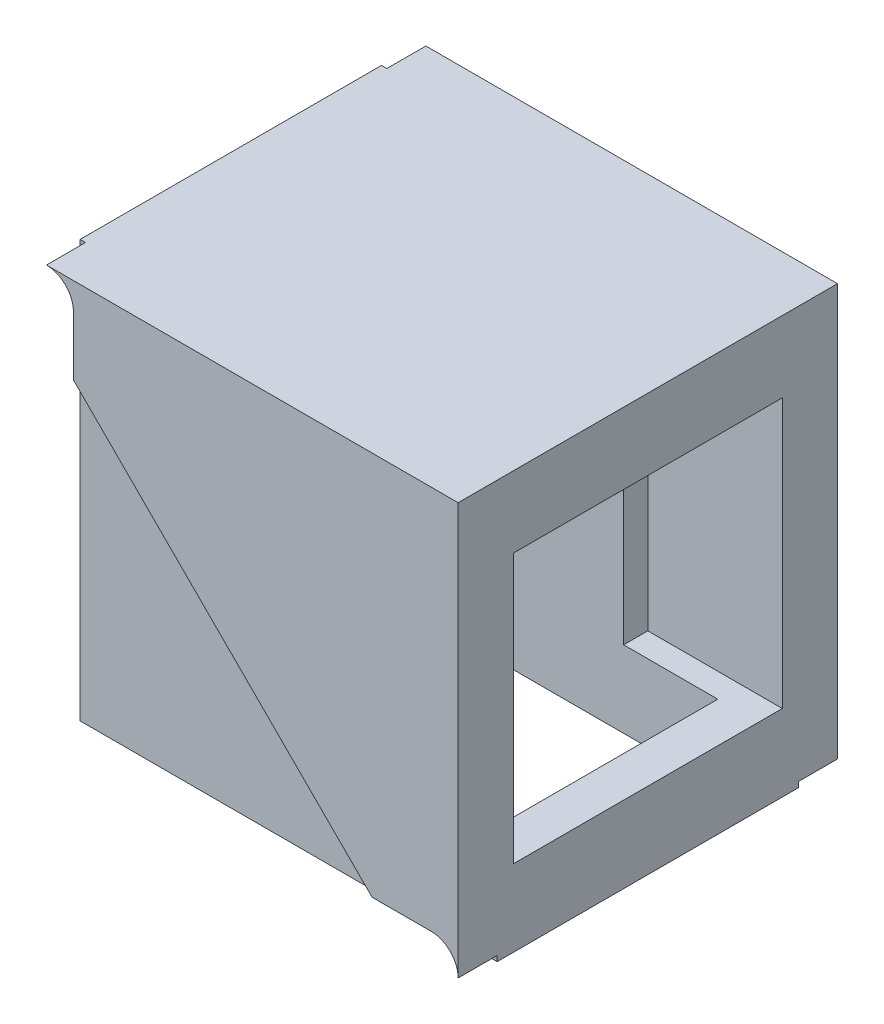
ISO-10303-21;
HEADER;
FILE_DESCRIPTION(('STEP AP214'),'2;1');
FILE_NAME('part.step','',(''),(''),'','','');
FILE_SCHEMA(('AUTOMOTIVE_DESIGN { 1 0 10303 214 1 1 1 1 }'));
ENDSEC;
DATA;
#1=APPLICATION_CONTEXT('core data for automotive mechanical design processes');
#2=APPLICATION_PROTOCOL_DEFINITION('international standard','automotive_design',2000,#1);
#3=PRODUCT_CONTEXT('',#1,'mechanical');
#4=PRODUCT('Part','Part','',(#3));
#5=PRODUCT_RELATED_PRODUCT_CATEGORY('part','',(#4));
#6=PRODUCT_DEFINITION_FORMATION('','',#4);
#7=PRODUCT_DEFINITION_CONTEXT('part definition',#1,'design');
#8=PRODUCT_DEFINITION('design','',#6,#7);
#9=PRODUCT_DEFINITION_SHAPE('','',#8);
#10=(LENGTH_UNIT() NAMED_UNIT(*) SI_UNIT(.MILLI.,.METRE.));
#11=(NAMED_UNIT(*) PLANE_ANGLE_UNIT() SI_UNIT($,.RADIAN.));
#12=(NAMED_UNIT(*) SI_UNIT($,.STERADIAN.) SOLID_ANGLE_UNIT());
#13=UNCERTAINTY_MEASURE_WITH_UNIT(LENGTH_MEASURE(1.E-05),#10,'distance_accuracy_value','');
#14=(GEOMETRIC_REPRESENTATION_CONTEXT(3) GLOBAL_UNCERTAINTY_ASSIGNED_CONTEXT((#13)) GLOBAL_UNIT_ASSIGNED_CONTEXT((#10,
#11,#12)) REPRESENTATION_CONTEXT('',''));
#15=CARTESIAN_POINT('',(0.,0.,0.));
#16=DIRECTION('',(0.,0.,1.));
#17=DIRECTION('',(1.,0.,0.));
#18=AXIS2_PLACEMENT_3D('',#15,#16,#17);
#19=CARTESIAN_POINT('',(32.0000000000212,3.99999999998279,-66.0406204336012));
#20=DIRECTION('',(1.,0.,0.));
#21=DIRECTION('',(0.,0.,-1.));
#22=AXIS2_PLACEMENT_3D('',#19,#20,#21);
#23=PLANE('',#22);
#24=DIRECTION('',(0.,1.,0.));
#25=VECTOR('',#24,1.);
#26=CARTESIAN_POINT('',(32.0000000000186,3.9999999999828,-5.80000000003517));
#27=LINE('',#26,#25);
#28=CARTESIAN_POINT('',(32.0000000000186,3.99999999998273,-5.80000000003517));
#29=VERTEX_POINT('',#28);
#30=CARTESIAN_POINT('',(32.0000000000186,9.69999999998245,-5.80000000003517));
#31=VERTEX_POINT('',#30);
#32=EDGE_CURVE('E354',#29,#31,#27,.T.);
#33=ORIENTED_EDGE('',*,*,#32,.T.);
#34=DIRECTION('',(0.,0.,-1.));
#35=VECTOR('',#34,1.);
#36=CARTESIAN_POINT('',(32.0000000000212,9.69999999998246,-66.0406204336012));
#37=LINE('',#36,#35);
#38=CARTESIAN_POINT('',(32.0000000000193,9.69999999998246,-22.2000000000352));
#39=VERTEX_POINT('',#38);
#40=EDGE_CURVE('E272',#31,#39,#37,.T.);
#41=ORIENTED_EDGE('',*,*,#40,.T.);
#42=DIRECTION('',(0.,-1.,0.));
#43=VECTOR('',#42,1.);
#44=CARTESIAN_POINT('',(32.0000000000193,3.99999999998279,-22.2000000000352));
#45=LINE('',#44,#43);
#46=CARTESIAN_POINT('',(32.0000000000203,3.99999999998273,-22.2000000000352));
#47=VERTEX_POINT('',#46);
#48=EDGE_CURVE('E348',#39,#47,#45,.T.);
#49=ORIENTED_EDGE('',*,*,#48,.T.);
#50=DIRECTION('',(0.,0.,1.));
#51=VECTOR('',#50,1.);
#52=CARTESIAN_POINT('',(32.0000000000212,3.99999999998279,-66.0406204336012));
#53=LINE('',#52,#51);
#54=EDGE_CURVE('E349',#47,#29,#53,.T.);
#55=ORIENTED_EDGE('',*,*,#54,.T.);
#56=EDGE_LOOP('',(#33,#41,#49,#55));
#57=FACE_BOUND('',#56,.T.);
#58=ADVANCED_FACE('F41',(#57),#23,.F.);
#59=CARTESIAN_POINT('',(1.10838757527151E-12,0.,-25.2000000000366));
#60=DIRECTION('',(0.,0.,1.));
#61=DIRECTION('',(1.,0.,0.));
#62=AXIS2_PLACEMENT_3D('',#59,#60,#61);
#63=PLANE('',#62);
#64=CARTESIAN_POINT('',(33.0000000000195,4.39999999998272,-25.2000000000351));
#65=DIRECTION('',(0.,0.,1.));
#66=DIRECTION('',(-1.,0.,0.));
#67=AXIS2_PLACEMENT_3D('',#64,#65,#66);
#68=CIRCLE('',#67,2.);
#69=CARTESIAN_POINT('',(35.0000000000195,4.39999999998272,-25.200000000035));
#70=VERTEX_POINT('',#69);
#71=CARTESIAN_POINT('',(33.0000000000195,6.39999999998272,-25.2000000000351));
#72=VERTEX_POINT('',#71);
#73=EDGE_CURVE('E391',#70,#72,#68,.T.);
#74=ORIENTED_EDGE('',*,*,#73,.F.);
#75=DIRECTION('',(0.,1.,0.));
#76=VECTOR('',#75,1.);
#77=CARTESIAN_POINT('',(35.0000000000195,3.9999999999828,-25.200000000035));
#78=LINE('',#77,#76);
#79=CARTESIAN_POINT('',(35.0000000000195,3.9999999999828,-25.200000000035));
#80=VERTEX_POINT('',#79);
#81=EDGE_CURVE('E416',#80,#70,#78,.T.);
#82=ORIENTED_EDGE('',*,*,#81,.F.);
#83=DIRECTION('',(1.,0.,0.));
#84=VECTOR('',#83,1.);
#85=CARTESIAN_POINT('',(4.00000000001943,3.99999999998213,-25.2000000000364));
#86=LINE('',#85,#84);
#87=CARTESIAN_POINT('',(4.00000000001943,3.99999999998213,-25.2000000000364));
#88=VERTEX_POINT('',#87);
#89=EDGE_CURVE('E420',#88,#80,#86,.T.);
#90=ORIENTED_EDGE('',*,*,#89,.F.);
#91=DIRECTION('',(0.,-1.,0.));
#92=VECTOR('',#91,1.);
#93=CARTESIAN_POINT('',(4.00000000001877,34.9999999999822,-25.2000000000364));
#94=LINE('',#93,#92);
#95=CARTESIAN_POINT('',(4.00000000001877,34.9999999999822,-25.2000000000364));
#96=VERTEX_POINT('',#95);
#97=EDGE_CURVE('E428',#96,#88,#94,.T.);
#98=ORIENTED_EDGE('',*,*,#97,.F.);
#99=DIRECTION('',(-1.,0.,0.));
#100=VECTOR('',#99,1.);
#101=CARTESIAN_POINT('',(35.0000000000195,34.9999999999822,-25.200000000035));
#102=LINE('',#101,#100);
#103=CARTESIAN_POINT('',(4.40000000001884,34.9999999999821,-25.2000000000364));
#104=VERTEX_POINT('',#103);
#105=EDGE_CURVE('E426',#104,#96,#102,.T.);
#106=ORIENTED_EDGE('',*,*,#105,.F.);
#107=CARTESIAN_POINT('',(4.40000000001888,32.9999999999821,-25.2000000000364));
#108=DIRECTION('',(0.,0.,1.));
#109=DIRECTION('',(-1.,0.,0.));
#110=AXIS2_PLACEMENT_3D('',#107,#108,#109);
#111=CIRCLE('',#110,2.);
#112=CARTESIAN_POINT('',(6.40000000001888,32.9999999999822,-25.2000000000363));
#113=VERTEX_POINT('',#112);
#114=EDGE_CURVE('E388',#113,#104,#111,.T.);
#115=ORIENTED_EDGE('',*,*,#114,.F.);
#116=DIRECTION('',(0.,1.,0.));
#117=VECTOR('',#116,1.);
#118=CARTESIAN_POINT('',(6.40000000001897,28.5999999999822,-25.2000000000363));
#119=LINE('',#118,#117);
#120=CARTESIAN_POINT('',(6.40000000001897,28.5999999999822,-25.2000000000363));
#121=VERTEX_POINT('',#120);
#122=EDGE_CURVE('E353',#121,#113,#119,.T.);
#123=ORIENTED_EDGE('',*,*,#122,.F.);
#124=DIRECTION('',(-0.707106781186563,0.707106781186532,0.));
#125=VECTOR('',#124,1.);
#126=CARTESIAN_POINT('',(6.40000000001897,28.5999999999822,-25.2000000000363));
#127=LINE('',#126,#125);
#128=CARTESIAN_POINT('',(28.6000000000195,6.39999999998262,-25.2000000000353));
#129=VERTEX_POINT('',#128);
#130=EDGE_CURVE('E372',#129,#121,#127,.T.);
#131=ORIENTED_EDGE('',*,*,#130,.F.);
#132=DIRECTION('',(-1.,0.,0.));
#133=VECTOR('',#132,1.);
#134=CARTESIAN_POINT('',(28.6000000000195,6.39999999998262,-25.2000000000353));
#135=LINE('',#134,#133);
#136=EDGE_CURVE('E394',#72,#129,#135,.T.);
#137=ORIENTED_EDGE('',*,*,#136,.F.);
#138=EDGE_LOOP('',(#74,#82,#90,#98,#106,#115,#123,#131,#137));
#139=FACE_BOUND('',#138,.T.);
#140=ADVANCED_FACE('F485',(#139),#63,.F.);
#141=CARTESIAN_POINT('',(35.0000000000193,3.9999999999828,-22.200000000035));
#142=DIRECTION('',(-1.,0.,0.));
#143=DIRECTION('',(0.,0.,1.));
#144=AXIS2_PLACEMENT_3D('',#141,#142,#143);
#145=PLANE('',#144);
#146=DIRECTION('',(0.,0.,1.));
#147=VECTOR('',#146,1.);
#148=CARTESIAN_POINT('',(35.0000000000194,29.6999999999825,-24.0000000000358));
#149=LINE('',#148,#147);
#150=CARTESIAN_POINT('',(35.0000000000194,29.6999999999825,-24.0000000000362));
#151=VERTEX_POINT('',#150);
#152=CARTESIAN_POINT('',(35.0000000000185,29.6999999999825,-4.00000000003581));
#153=VERTEX_POINT('',#152);
#154=EDGE_CURVE('E257',#151,#153,#149,.T.);
#155=ORIENTED_EDGE('',*,*,#154,.F.);
#156=DIRECTION('',(0.,1.,0.));
#157=VECTOR('',#156,1.);
#158=CARTESIAN_POINT('',(35.0000000000194,29.6999999999825,-24.0000000000358));
#159=LINE('',#158,#157);
#160=CARTESIAN_POINT('',(35.0000000000194,9.69999999998246,-24.0000000000358));
#161=VERTEX_POINT('',#160);
#162=EDGE_CURVE('E56',#161,#151,#159,.T.);
#163=ORIENTED_EDGE('',*,*,#162,.F.);
#164=DIRECTION('',(0.,0.,-1.));
#165=VECTOR('',#164,1.);
#166=CARTESIAN_POINT('',(35.0000000000194,9.69999999998246,-24.0000000000358));
#167=LINE('',#166,#165);
#168=CARTESIAN_POINT('',(35.0000000000185,9.69999999998245,-4.00000000003581));
#169=VERTEX_POINT('',#168);
#170=EDGE_CURVE('E248',#169,#161,#167,.T.);
#171=ORIENTED_EDGE('',*,*,#170,.F.);
#172=DIRECTION('',(0.,-1.,0.));
#173=VECTOR('',#172,1.);
#174=CARTESIAN_POINT('',(35.0000000000185,29.6999999999825,-4.00000000003581));
#175=LINE('',#174,#173);
#176=EDGE_CURVE('E251',#153,#169,#175,.T.);
#177=ORIENTED_EDGE('',*,*,#176,.F.);
#178=EDGE_LOOP('',(#155,#163,#171,#177));
#179=FACE_BOUND('',#178,.T.);
#180=ORIENTED_EDGE('',*,*,#81,.T.);
#181=DIRECTION('',(0.,0.,1.));
#182=VECTOR('',#181,1.);
#183=CARTESIAN_POINT('',(35.0000000000196,4.39999999998276,-28.100000000035));
#184=LINE('',#183,#182);
#185=CARTESIAN_POINT('',(35.0000000000196,4.39999999998276,-28.100000000035));
#186=VERTEX_POINT('',#185);
#187=EDGE_CURVE('E407',#186,#70,#184,.T.);
#188=ORIENTED_EDGE('',*,*,#187,.F.);
#189=DIRECTION('',(0.,-1.,0.));
#190=VECTOR('',#189,1.);
#191=CARTESIAN_POINT('',(35.0000000000196,4.39999999998276,-28.100000000035));
#192=LINE('',#191,#190);
#193=CARTESIAN_POINT('',(35.0000000000196,34.9999999999822,-28.100000000035));
#194=VERTEX_POINT('',#193);
#195=EDGE_CURVE('E377',#194,#186,#192,.T.);
#196=ORIENTED_EDGE('',*,*,#195,.F.);
#197=DIRECTION('',(0.,0.,-1.));
#198=VECTOR('',#197,1.);
#199=CARTESIAN_POINT('',(35.0000000000193,34.9999999999822,-22.200000000035));
#200=LINE('',#199,#198);
#201=CARTESIAN_POINT('',(35.0000000000196,34.9999999999822,0.0999999999634219));
#202=VERTEX_POINT('',#201);
#203=EDGE_CURVE('E439',#202,#194,#200,.T.);
#204=ORIENTED_EDGE('',*,*,#203,.F.);
#205=DIRECTION('',(0.,1.,0.));
#206=VECTOR('',#205,1.);
#207=CARTESIAN_POINT('',(35.0000000000196,4.39999999998276,0.0999999999634219));
#208=LINE('',#207,#206);
#209=CARTESIAN_POINT('',(35.0000000000196,4.39999999998276,0.0999999999634219));
#210=VERTEX_POINT('',#209);
#211=EDGE_CURVE('E286',#210,#202,#208,.T.);
#212=ORIENTED_EDGE('',*,*,#211,.F.);
#213=DIRECTION('',(0.,0.,-1.));
#214=VECTOR('',#213,1.);
#215=CARTESIAN_POINT('',(35.0000000000196,4.39999999998276,0.0999999999634219));
#216=LINE('',#215,#214);
#217=CARTESIAN_POINT('',(35.0000000000185,4.39999999998272,-2.80000000003658));
#218=VERTEX_POINT('',#217);
#219=EDGE_CURVE('E317',#210,#218,#216,.T.);
#220=ORIENTED_EDGE('',*,*,#219,.T.);
#221=DIRECTION('',(0.,1.,0.));
#222=VECTOR('',#221,1.);
#223=CARTESIAN_POINT('',(35.0000000000185,3.9999999999828,-2.80000000003504));
#224=LINE('',#223,#222);
#225=CARTESIAN_POINT('',(35.0000000000185,3.9999999999828,-2.80000000003504));
#226=VERTEX_POINT('',#225);
#227=EDGE_CURVE('E336',#226,#218,#224,.T.);
#228=ORIENTED_EDGE('',*,*,#227,.F.);
#229=DIRECTION('',(0.,0.,-1.));
#230=VECTOR('',#229,1.);
#231=CARTESIAN_POINT('',(35.0000000000193,3.9999999999828,-22.200000000035));
#232=LINE('',#231,#230);
#233=EDGE_CURVE('E423',#226,#80,#232,.T.);
#234=ORIENTED_EDGE('',*,*,#233,.T.);
#235=EDGE_LOOP('',(#180,#188,#196,#204,#212,#220,#228,#234));
#236=FACE_BOUND('',#235,.T.);
#237=ADVANCED_FACE('F43',(#179,#236),#145,.F.);
#238=CARTESIAN_POINT('',(35.0000000000193,34.9999999999822,-22.200000000035));
#239=DIRECTION('',(0.,-1.,0.));
#240=DIRECTION('',(0.,0.,-1.));
#241=AXIS2_PLACEMENT_3D('',#238,#239,#240);
#242=PLANE('',#241);
#243=ORIENTED_EDGE('',*,*,#203,.T.);
#244=DIRECTION('',(1.,0.,0.));
#245=VECTOR('',#244,1.);
#246=CARTESIAN_POINT('',(35.0000000000196,34.9999999999822,-28.100000000035));
#247=LINE('',#246,#245);
#248=CARTESIAN_POINT('',(4.40000000001896,34.9999999999821,-28.1000000000364));
#249=VERTEX_POINT('',#248);
#250=EDGE_CURVE('E374',#249,#194,#247,.T.);
#251=ORIENTED_EDGE('',*,*,#250,.F.);
#252=DIRECTION('',(0.,0.,1.));
#253=VECTOR('',#252,1.);
#254=CARTESIAN_POINT('',(4.40000000001896,34.9999999999821,-28.1000000000364));
#255=LINE('',#254,#253);
#256=EDGE_CURVE('E410',#249,#104,#255,.T.);
#257=ORIENTED_EDGE('',*,*,#256,.T.);
#258=ORIENTED_EDGE('',*,*,#105,.T.);
#259=DIRECTION('',(0.,0.,-1.));
#260=VECTOR('',#259,1.);
#261=CARTESIAN_POINT('',(4.00000000001863,34.9999999999822,-22.2000000000364));
#262=LINE('',#261,#260);
#263=CARTESIAN_POINT('',(4.00000000001777,34.9999999999822,-2.80000000003641));
#264=VERTEX_POINT('',#263);
#265=EDGE_CURVE('E436',#264,#96,#262,.T.);
#266=ORIENTED_EDGE('',*,*,#265,.F.);
#267=DIRECTION('',(-1.,0.,0.));
#268=VECTOR('',#267,1.);
#269=CARTESIAN_POINT('',(4.00000000001777,34.9999999999822,-2.80000000003641));
#270=LINE('',#269,#268);
#271=CARTESIAN_POINT('',(4.400000000019,34.9999999999822,-2.80000000003658));
#272=VERTEX_POINT('',#271);
#273=EDGE_CURVE('E338',#272,#264,#270,.T.);
#274=ORIENTED_EDGE('',*,*,#273,.F.);
#275=DIRECTION('',(0.,0.,-1.));
#276=VECTOR('',#275,1.);
#277=CARTESIAN_POINT('',(4.40000000001896,34.9999999999821,0.0999999999634219));
#278=LINE('',#277,#276);
#279=CARTESIAN_POINT('',(4.40000000001896,34.9999999999821,0.0999999999634219));
#280=VERTEX_POINT('',#279);
#281=EDGE_CURVE('E314',#280,#272,#278,.T.);
#282=ORIENTED_EDGE('',*,*,#281,.F.);
#283=DIRECTION('',(-1.,0.,0.));
#284=VECTOR('',#283,1.);
#285=CARTESIAN_POINT('',(35.0000000000196,34.9999999999822,0.0999999999634219));
#286=LINE('',#285,#284);
#287=EDGE_CURVE('E289',#202,#280,#286,.T.);
#288=ORIENTED_EDGE('',*,*,#287,.F.);
#289=EDGE_LOOP('',(#243,#251,#257,#258,#266,#274,#282,#288));
#290=FACE_BOUND('',#289,.T.);
#291=ADVANCED_FACE('F484',(#290),#242,.F.);
#292=CARTESIAN_POINT('',(4.00000000001863,34.9999999999822,-22.2000000000364));
#293=DIRECTION('',(1.,0.,0.));
#294=DIRECTION('',(0.,0.,-1.));
#295=AXIS2_PLACEMENT_3D('',#292,#293,#294);
#296=PLANE('',#295);
#297=ORIENTED_EDGE('',*,*,#97,.T.);
#298=DIRECTION('',(0.,0.,-1.));
#299=VECTOR('',#298,1.);
#300=CARTESIAN_POINT('',(4.0000000000193,3.99999999998213,-22.2000000000364));
#301=LINE('',#300,#299);
#302=CARTESIAN_POINT('',(4.0000000000193,3.99999999998213,-22.2000000000364));
#303=VERTEX_POINT('',#302);
#304=EDGE_CURVE('E433',#303,#88,#301,.T.);
#305=ORIENTED_EDGE('',*,*,#304,.F.);
#306=DIRECTION('',(0.,-1.,0.));
#307=VECTOR('',#306,1.);
#308=CARTESIAN_POINT('',(4.00000000001863,34.9999999999822,-22.2000000000364));
#309=LINE('',#308,#307);
#310=CARTESIAN_POINT('',(4.0000000000187,31.9999999999821,-22.2000000000364));
#311=VERTEX_POINT('',#310);
#312=EDGE_CURVE('E417',#311,#303,#309,.T.);
#313=ORIENTED_EDGE('',*,*,#312,.F.);
#314=DIRECTION('',(0.,0.,1.));
#315=VECTOR('',#314,1.);
#316=CARTESIAN_POINT('',(4.00000000002121,31.9999999999821,-66.0406204336024));
#317=LINE('',#316,#315);
#318=CARTESIAN_POINT('',(4.00000000001796,31.9999999999821,-5.80000000003641));
#319=VERTEX_POINT('',#318);
#320=EDGE_CURVE('E360',#311,#319,#317,.T.);
#321=ORIENTED_EDGE('',*,*,#320,.T.);
#322=DIRECTION('',(0.,-1.,0.));
#323=VECTOR('',#322,1.);
#324=CARTESIAN_POINT('',(4.00000000001856,3.99999999998213,-5.8000000000364));
#325=LINE('',#324,#323);
#326=CARTESIAN_POINT('',(4.00000000001856,3.99999999998213,-5.8000000000364));
#327=VERTEX_POINT('',#326);
#328=EDGE_CURVE('E330',#319,#327,#325,.T.);
#329=ORIENTED_EDGE('',*,*,#328,.T.);
#330=DIRECTION('',(0.,0.,1.));
#331=VECTOR('',#330,1.);
#332=CARTESIAN_POINT('',(4.00000000001856,3.99999999998213,-5.8000000000364));
#333=LINE('',#332,#331);
#334=CARTESIAN_POINT('',(4.00000000001843,3.99999999998213,-2.8000000000364));
#335=VERTEX_POINT('',#334);
#336=EDGE_CURVE('E333',#327,#335,#333,.T.);
#337=ORIENTED_EDGE('',*,*,#336,.T.);
#338=DIRECTION('',(0.,-1.,0.));
#339=VECTOR('',#338,1.);
#340=CARTESIAN_POINT('',(4.00000000001843,3.99999999998213,-2.8000000000364));
#341=LINE('',#340,#339);
#342=EDGE_CURVE('E331',#264,#335,#341,.T.);
#343=ORIENTED_EDGE('',*,*,#342,.F.);
#344=ORIENTED_EDGE('',*,*,#265,.T.);
#345=EDGE_LOOP('',(#297,#305,#313,#321,#329,#337,#343,#344));
#346=FACE_BOUND('',#345,.T.);
#347=ADVANCED_FACE('F464',(#346),#296,.F.);
#348=CARTESIAN_POINT('',(4.0000000000193,3.99999999998213,-22.2000000000364));
#349=DIRECTION('',(0.,1.,0.));
#350=DIRECTION('',(-1.,0.,0.));
#351=AXIS2_PLACEMENT_3D('',#348,#349,#350);
#352=PLANE('',#351);
#353=ORIENTED_EDGE('',*,*,#89,.T.);
#354=ORIENTED_EDGE('',*,*,#233,.F.);
#355=DIRECTION('',(1.,0.,0.));
#356=VECTOR('',#355,1.);
#357=CARTESIAN_POINT('',(35.0000000000185,3.9999999999828,-2.80000000003504));
#358=LINE('',#357,#356);
#359=EDGE_CURVE('E326',#335,#226,#358,.T.);
#360=ORIENTED_EDGE('',*,*,#359,.F.);
#361=ORIENTED_EDGE('',*,*,#336,.F.);
#362=DIRECTION('',(1.,0.,0.));
#363=VECTOR('',#362,1.);
#364=CARTESIAN_POINT('',(35.0000000000186,3.9999999999828,-5.80000000003504));
#365=LINE('',#364,#363);
#366=EDGE_CURVE('E327',#327,#29,#365,.T.);
#367=ORIENTED_EDGE('',*,*,#366,.T.);
#368=ORIENTED_EDGE('',*,*,#54,.F.);
#369=DIRECTION('',(1.,0.,0.));
#370=VECTOR('',#369,1.);
#371=CARTESIAN_POINT('',(4.0000000000193,3.99999999998213,-22.2000000000364));
#372=LINE('',#371,#370);
#373=EDGE_CURVE('E419',#303,#47,#372,.T.);
#374=ORIENTED_EDGE('',*,*,#373,.F.);
#375=ORIENTED_EDGE('',*,*,#304,.T.);
#376=EDGE_LOOP('',(#353,#354,#360,#361,#367,#368,#374,#375));
#377=FACE_BOUND('',#376,.T.);
#378=ADVANCED_FACE('F470',(#377),#352,.F.);
#379=CARTESIAN_POINT('',(9.76655111237216E-13,0.,-22.2000000000366));
#380=DIRECTION('',(0.,0.,1.));
#381=DIRECTION('',(1.,0.,0.));
#382=AXIS2_PLACEMENT_3D('',#379,#380,#381);
#383=PLANE('',#382);
#384=DIRECTION('',(1.,0.,0.));
#385=VECTOR('',#384,1.);
#386=CARTESIAN_POINT('',(9.76655111237216E-13,9.69999999998246,-22.2000000000366));
#387=LINE('',#386,#385);
#388=CARTESIAN_POINT('',(25.0000000000193,9.69999999998246,-22.2000000000355));
#389=VERTEX_POINT('',#388);
#390=EDGE_CURVE('E275',#389,#39,#387,.T.);
#391=ORIENTED_EDGE('',*,*,#390,.F.);
#392=DIRECTION('',(0.,-1.,0.));
#393=VECTOR('',#392,1.);
#394=CARTESIAN_POINT('',(25.0000000000193,0.,-22.2000000000355));
#395=LINE('',#394,#393);
#396=CARTESIAN_POINT('',(25.0000000000193,29.6999999999825,-22.2000000000355));
#397=VERTEX_POINT('',#396);
#398=EDGE_CURVE('E263',#397,#389,#395,.T.);
#399=ORIENTED_EDGE('',*,*,#398,.F.);
#400=DIRECTION('',(-1.,0.,0.));
#401=VECTOR('',#400,1.);
#402=CARTESIAN_POINT('',(9.76655111237216E-13,29.6999999999825,-22.2000000000366));
#403=LINE('',#402,#401);
#404=CARTESIAN_POINT('',(32.0000000000193,29.6999999999825,-22.2000000000352));
#405=VERTEX_POINT('',#404);
#406=EDGE_CURVE('E238',#405,#397,#403,.T.);
#407=ORIENTED_EDGE('',*,*,#406,.F.);
#408=CARTESIAN_POINT('',(32.0000000000212,31.9999999999821,-22.2000000000352));
#409=VERTEX_POINT('',#408);
#410=EDGE_CURVE('E350',#409,#405,#45,.T.);
#411=ORIENTED_EDGE('',*,*,#410,.F.);
#412=DIRECTION('',(1.,0.,0.));
#413=VECTOR('',#412,1.);
#414=CARTESIAN_POINT('',(4.00000000001928,31.9999999999821,-22.2000000000364));
#415=LINE('',#414,#413);
#416=EDGE_CURVE('E345',#311,#409,#415,.T.);
#417=ORIENTED_EDGE('',*,*,#416,.F.);
#418=ORIENTED_EDGE('',*,*,#312,.T.);
#419=ORIENTED_EDGE('',*,*,#373,.T.);
#420=ORIENTED_EDGE('',*,*,#48,.F.);
#421=EDGE_LOOP('',(#391,#399,#407,#411,#417,#418,#419,#420));
#422=FACE_BOUND('',#421,.T.);
#423=ADVANCED_FACE('F461',(#422),#383,.T.);
#424=CARTESIAN_POINT('',(6.4000000000191,28.5999999999822,-28.1000000000363));
#425=DIRECTION('',(1.,0.,0.));
#426=DIRECTION('',(0.,0.,-1.));
#427=AXIS2_PLACEMENT_3D('',#424,#425,#426);
#428=PLANE('',#427);
#429=ORIENTED_EDGE('',*,*,#122,.T.);
#430=DIRECTION('',(0.,0.,1.));
#431=VECTOR('',#430,1.);
#432=CARTESIAN_POINT('',(6.40000000001901,32.9999999999822,-28.1000000000363));
#433=LINE('',#432,#431);
#434=CARTESIAN_POINT('',(6.40000000001901,32.9999999999822,-28.1000000000363));
#435=VERTEX_POINT('',#434);
#436=EDGE_CURVE('E413',#435,#113,#433,.T.);
#437=ORIENTED_EDGE('',*,*,#436,.F.);
#438=DIRECTION('',(0.,1.,0.));
#439=VECTOR('',#438,1.);
#440=CARTESIAN_POINT('',(6.4000000000191,28.5999999999822,-28.1000000000363));
#441=LINE('',#440,#439);
#442=CARTESIAN_POINT('',(6.4000000000191,28.5999999999822,-28.1000000000363));
#443=VERTEX_POINT('',#442);
#444=EDGE_CURVE('E368',#443,#435,#441,.T.);
#445=ORIENTED_EDGE('',*,*,#444,.F.);
#446=DIRECTION('',(0.,0.,1.));
#447=VECTOR('',#446,1.);
#448=CARTESIAN_POINT('',(6.4000000000191,28.5999999999822,-28.1000000000363));
#449=LINE('',#448,#447);
#450=EDGE_CURVE('E385',#443,#121,#449,.T.);
#451=ORIENTED_EDGE('',*,*,#450,.T.);
#452=EDGE_LOOP('',(#429,#437,#445,#451));
#453=FACE_BOUND('',#452,.T.);
#454=ADVANCED_FACE('F537',(#453),#428,.F.);
#455=CARTESIAN_POINT('',(4.400000000019,32.9999999999821,-28.1000000000364));
#456=DIRECTION('',(0.,0.,1.));
#457=DIRECTION('',(1.,0.,0.));
#458=AXIS2_PLACEMENT_3D('',#455,#456,#457);
#459=CYLINDRICAL_SURFACE('',#458,2.);
#460=ORIENTED_EDGE('',*,*,#114,.T.);
#461=ORIENTED_EDGE('',*,*,#256,.F.);
#462=CARTESIAN_POINT('',(4.400000000019,32.9999999999821,-28.1000000000364));
#463=DIRECTION('',(0.,0.,1.));
#464=DIRECTION('',(-1.,0.,0.));
#465=AXIS2_PLACEMENT_3D('',#462,#463,#464);
#466=CIRCLE('',#465,2.);
#467=EDGE_CURVE('E371',#435,#249,#466,.T.);
#468=ORIENTED_EDGE('',*,*,#467,.F.);
#469=ORIENTED_EDGE('',*,*,#436,.T.);
#470=EDGE_LOOP('',(#460,#461,#468,#469));
#471=FACE_BOUND('',#470,.T.);
#472=ADVANCED_FACE('F533',(#471),#459,.F.);
#473=CARTESIAN_POINT('',(33.0000000000196,4.39999999998272,-28.1000000000351));
#474=DIRECTION('',(0.,0.,1.));
#475=DIRECTION('',(1.,0.,0.));
#476=AXIS2_PLACEMENT_3D('',#473,#474,#475);
#477=CYLINDRICAL_SURFACE('',#476,2.);
#478=ORIENTED_EDGE('',*,*,#73,.T.);
#479=DIRECTION('',(0.,0.,1.));
#480=VECTOR('',#479,1.);
#481=CARTESIAN_POINT('',(33.0000000000196,6.39999999998272,-28.1000000000351));
#482=LINE('',#481,#480);
#483=CARTESIAN_POINT('',(33.0000000000196,6.39999999998272,-28.1000000000351));
#484=VERTEX_POINT('',#483);
#485=EDGE_CURVE('E404',#484,#72,#482,.T.);
#486=ORIENTED_EDGE('',*,*,#485,.F.);
#487=CARTESIAN_POINT('',(33.0000000000196,4.39999999998272,-28.1000000000351));
#488=DIRECTION('',(0.,0.,1.));
#489=DIRECTION('',(-1.,0.,0.));
#490=AXIS2_PLACEMENT_3D('',#487,#488,#489);
#491=CIRCLE('',#490,2.);
#492=EDGE_CURVE('E379',#186,#484,#491,.T.);
#493=ORIENTED_EDGE('',*,*,#492,.F.);
#494=ORIENTED_EDGE('',*,*,#187,.T.);
#495=EDGE_LOOP('',(#478,#486,#493,#494));
#496=FACE_BOUND('',#495,.T.);
#497=ADVANCED_FACE('F493',(#496),#477,.F.);
#498=CARTESIAN_POINT('',(28.6000000000196,6.39999999998262,-28.1000000000353));
#499=DIRECTION('',(0.,1.,0.));
#500=DIRECTION('',(-1.,0.,0.));
#501=AXIS2_PLACEMENT_3D('',#498,#499,#500);
#502=PLANE('',#501);
#503=ORIENTED_EDGE('',*,*,#136,.T.);
#504=DIRECTION('',(0.,0.,1.));
#505=VECTOR('',#504,1.);
#506=CARTESIAN_POINT('',(28.6000000000196,6.39999999998262,-28.1000000000353));
#507=LINE('',#506,#505);
#508=CARTESIAN_POINT('',(28.6000000000196,6.39999999998262,-28.1000000000353));
#509=VERTEX_POINT('',#508);
#510=EDGE_CURVE('E401',#509,#129,#507,.T.);
#511=ORIENTED_EDGE('',*,*,#510,.F.);
#512=DIRECTION('',(-1.,0.,0.));
#513=VECTOR('',#512,1.);
#514=CARTESIAN_POINT('',(28.6000000000196,6.39999999998262,-28.1000000000353));
#515=LINE('',#514,#513);
#516=EDGE_CURVE('E381',#484,#509,#515,.T.);
#517=ORIENTED_EDGE('',*,*,#516,.F.);
#518=ORIENTED_EDGE('',*,*,#485,.T.);
#519=EDGE_LOOP('',(#503,#511,#517,#518));
#520=FACE_BOUND('',#519,.T.);
#521=ADVANCED_FACE('F543',(#520),#502,.F.);
#522=CARTESIAN_POINT('',(6.4000000000191,28.5999999999822,-28.1000000000363));
#523=DIRECTION('',(0.707106781186532,0.707106781186563,0.));
#524=DIRECTION('',(-0.707106781186563,0.707106781186532,0.));
#525=AXIS2_PLACEMENT_3D('',#522,#523,#524);
#526=PLANE('',#525);
#527=ORIENTED_EDGE('',*,*,#130,.T.);
#528=ORIENTED_EDGE('',*,*,#450,.F.);
#529=DIRECTION('',(-0.707106781186563,0.707106781186532,0.));
#530=VECTOR('',#529,1.);
#531=CARTESIAN_POINT('',(6.4000000000191,28.5999999999822,-28.1000000000363));
#532=LINE('',#531,#530);
#533=EDGE_CURVE('E383',#509,#443,#532,.T.);
#534=ORIENTED_EDGE('',*,*,#533,.F.);
#535=ORIENTED_EDGE('',*,*,#510,.T.);
#536=EDGE_LOOP('',(#527,#528,#534,#535));
#537=FACE_BOUND('',#536,.T.);
#538=ADVANCED_FACE('F540',(#537),#526,.F.);
#539=CARTESIAN_POINT('',(4.400000000019,32.9999999999821,-28.1000000000364));
#540=DIRECTION('',(0.,0.,-1.));
#541=DIRECTION('',(-1.,0.,0.));
#542=AXIS2_PLACEMENT_3D('',#539,#540,#541);
#543=PLANE('',#542);
#544=ORIENTED_EDGE('',*,*,#444,.T.);
#545=ORIENTED_EDGE('',*,*,#467,.T.);
#546=ORIENTED_EDGE('',*,*,#250,.T.);
#547=ORIENTED_EDGE('',*,*,#195,.T.);
#548=ORIENTED_EDGE('',*,*,#492,.T.);
#549=ORIENTED_EDGE('',*,*,#516,.T.);
#550=ORIENTED_EDGE('',*,*,#533,.T.);
#551=EDGE_LOOP('',(#544,#545,#546,#547,#548,#549,#550));
#552=FACE_BOUND('',#551,.T.);
#553=ADVANCED_FACE('F497',(#552),#543,.T.);
#554=CARTESIAN_POINT('',(4.00000000002121,31.9999999999821,-66.0406204336024));
#555=DIRECTION('',(0.,1.,0.));
#556=DIRECTION('',(-1.,0.,0.));
#557=AXIS2_PLACEMENT_3D('',#554,#555,#556);
#558=PLANE('',#557);
#559=ORIENTED_EDGE('',*,*,#320,.F.);
#560=ORIENTED_EDGE('',*,*,#416,.T.);
#561=DIRECTION('',(0.,0.,1.));
#562=VECTOR('',#561,1.);
#563=CARTESIAN_POINT('',(32.0000000000212,31.9999999999821,-66.0406204336012));
#564=LINE('',#563,#562);
#565=CARTESIAN_POINT('',(32.0000000000186,31.9999999999821,-5.80000000003518));
#566=VERTEX_POINT('',#565);
#567=EDGE_CURVE('E363',#409,#566,#564,.T.);
#568=ORIENTED_EDGE('',*,*,#567,.T.);
#569=DIRECTION('',(-1.,0.,0.));
#570=VECTOR('',#569,1.);
#571=CARTESIAN_POINT('',(4.00000000001856,31.9999999999821,-5.80000000003641));
#572=LINE('',#571,#570);
#573=EDGE_CURVE('E357',#566,#319,#572,.T.);
#574=ORIENTED_EDGE('',*,*,#573,.T.);
#575=EDGE_LOOP('',(#559,#560,#568,#574));
#576=FACE_BOUND('',#575,.T.);
#577=ADVANCED_FACE('F457',(#576),#558,.F.);
#578=ORIENTED_EDGE('',*,*,#410,.T.);
#579=DIRECTION('',(0.,0.,1.));
#580=VECTOR('',#579,1.);
#581=CARTESIAN_POINT('',(32.0000000000212,29.6999999999825,-66.0406204336012));
#582=LINE('',#581,#580);
#583=CARTESIAN_POINT('',(32.0000000000186,29.6999999999825,-5.80000000003518));
#584=VERTEX_POINT('',#583);
#585=EDGE_CURVE('E268',#405,#584,#582,.T.);
#586=ORIENTED_EDGE('',*,*,#585,.T.);
#587=EDGE_CURVE('E344',#584,#566,#27,.T.);
#588=ORIENTED_EDGE('',*,*,#587,.T.);
#589=ORIENTED_EDGE('',*,*,#567,.F.);
#590=EDGE_LOOP('',(#578,#586,#588,#589));
#591=FACE_BOUND('',#590,.T.);
#592=ADVANCED_FACE('F449',(#591),#23,.F.);
#593=CARTESIAN_POINT('',(2.54690783189576E-13,0.,-5.80000000003658));
#594=DIRECTION('',(0.,0.,-1.));
#595=DIRECTION('',(-1.,0.,0.));
#596=AXIS2_PLACEMENT_3D('',#593,#594,#595);
#597=PLANE('',#596);
#598=DIRECTION('',(-1.,0.,0.));
#599=VECTOR('',#598,1.);
#600=CARTESIAN_POINT('',(2.54690783189576E-13,9.69999999998245,-5.80000000003658));
#601=LINE('',#600,#599);
#602=CARTESIAN_POINT('',(25.0000000000186,9.69999999998245,-5.80000000003548));
#603=VERTEX_POINT('',#602);
#604=EDGE_CURVE('E11',#31,#603,#601,.T.);
#605=ORIENTED_EDGE('',*,*,#604,.F.);
#606=ORIENTED_EDGE('',*,*,#32,.F.);
#607=ORIENTED_EDGE('',*,*,#366,.F.);
#608=ORIENTED_EDGE('',*,*,#328,.F.);
#609=ORIENTED_EDGE('',*,*,#573,.F.);
#610=ORIENTED_EDGE('',*,*,#587,.F.);
#611=DIRECTION('',(1.,0.,0.));
#612=VECTOR('',#611,1.);
#613=CARTESIAN_POINT('',(2.54690783189576E-13,29.6999999999825,-5.80000000003658));
#614=LINE('',#613,#612);
#615=CARTESIAN_POINT('',(25.0000000000186,29.6999999999825,-5.80000000003548));
#616=VERTEX_POINT('',#615);
#617=EDGE_CURVE('E49',#616,#584,#614,.T.);
#618=ORIENTED_EDGE('',*,*,#617,.F.);
#619=DIRECTION('',(0.,1.,0.));
#620=VECTOR('',#619,1.);
#621=CARTESIAN_POINT('',(25.0000000000186,0.,-5.80000000003548));
#622=LINE('',#621,#620);
#623=EDGE_CURVE('E441',#603,#616,#622,.T.);
#624=ORIENTED_EDGE('',*,*,#623,.F.);
#625=EDGE_LOOP('',(#605,#606,#607,#608,#609,#610,#618,#624));
#626=FACE_BOUND('',#625,.T.);
#627=ADVANCED_FACE('F453',(#626),#597,.T.);
#628=CARTESIAN_POINT('',(1.22958319155278E-13,0.,-2.80000000003658));
#629=DIRECTION('',(0.,0.,-1.));
#630=DIRECTION('',(-1.,0.,0.));
#631=AXIS2_PLACEMENT_3D('',#628,#629,#630);
#632=PLANE('',#631);
#633=CARTESIAN_POINT('',(4.400000000019,32.9999999999821,-2.80000000003658));
#634=DIRECTION('',(0.,0.,-1.));
#635=DIRECTION('',(1.,0.,0.));
#636=AXIS2_PLACEMENT_3D('',#633,#634,#635);
#637=CIRCLE('',#636,2.);
#638=CARTESIAN_POINT('',(6.40000000001901,32.9999999999822,-2.80000000003658));
#639=VERTEX_POINT('',#638);
#640=EDGE_CURVE('E304',#272,#639,#637,.T.);
#641=ORIENTED_EDGE('',*,*,#640,.F.);
#642=ORIENTED_EDGE('',*,*,#273,.T.);
#643=ORIENTED_EDGE('',*,*,#342,.T.);
#644=ORIENTED_EDGE('',*,*,#359,.T.);
#645=ORIENTED_EDGE('',*,*,#227,.T.);
#646=CARTESIAN_POINT('',(33.0000000000196,4.39999999998272,-2.80000000003658));
#647=DIRECTION('',(0.,0.,-1.));
#648=DIRECTION('',(1.,0.,0.));
#649=AXIS2_PLACEMENT_3D('',#646,#647,#648);
#650=CIRCLE('',#649,2.);
#651=CARTESIAN_POINT('',(33.0000000000196,6.39999999998272,-2.80000000003658));
#652=VERTEX_POINT('',#651);
#653=EDGE_CURVE('E301',#652,#218,#650,.T.);
#654=ORIENTED_EDGE('',*,*,#653,.F.);
#655=DIRECTION('',(1.,0.,0.));
#656=VECTOR('',#655,1.);
#657=CARTESIAN_POINT('',(28.6000000000196,6.39999999998262,-2.80000000003658));
#658=LINE('',#657,#656);
#659=CARTESIAN_POINT('',(28.6000000000196,6.39999999998262,-2.80000000003658));
#660=VERTEX_POINT('',#659);
#661=EDGE_CURVE('E298',#660,#652,#658,.T.);
#662=ORIENTED_EDGE('',*,*,#661,.F.);
#663=DIRECTION('',(0.707106781186563,-0.707106781186532,0.));
#664=VECTOR('',#663,1.);
#665=CARTESIAN_POINT('',(6.4000000000191,28.5999999999822,-2.80000000003658));
#666=LINE('',#665,#664);
#667=CARTESIAN_POINT('',(6.4000000000191,28.5999999999822,-2.80000000003658));
#668=VERTEX_POINT('',#667);
#669=EDGE_CURVE('E277',#668,#660,#666,.T.);
#670=ORIENTED_EDGE('',*,*,#669,.F.);
#671=DIRECTION('',(0.,-1.,0.));
#672=VECTOR('',#671,1.);
#673=CARTESIAN_POINT('',(6.40000000001901,32.9999999999822,-2.80000000003658));
#674=LINE('',#673,#672);
#675=EDGE_CURVE('E282',#639,#668,#674,.T.);
#676=ORIENTED_EDGE('',*,*,#675,.F.);
#677=EDGE_LOOP('',(#641,#642,#643,#644,#645,#654,#662,#670,#676));
#678=FACE_BOUND('',#677,.T.);
#679=ADVANCED_FACE('F528',(#678),#632,.F.);
#680=CARTESIAN_POINT('',(6.4000000000191,28.5999999999822,0.0999999999634219));
#681=DIRECTION('',(0.707106781186532,0.707106781186563,0.));
#682=DIRECTION('',(-0.707106781186563,0.707106781186532,0.));
#683=AXIS2_PLACEMENT_3D('',#680,#681,#682);
#684=PLANE('',#683);
#685=ORIENTED_EDGE('',*,*,#669,.T.);
#686=DIRECTION('',(0.,0.,-1.));
#687=VECTOR('',#686,1.);
#688=CARTESIAN_POINT('',(28.6000000000196,6.39999999998262,0.0999999999634219));
#689=LINE('',#688,#687);
#690=CARTESIAN_POINT('',(28.6000000000196,6.39999999998262,0.0999999999634219));
#691=VERTEX_POINT('',#690);
#692=EDGE_CURVE('E323',#691,#660,#689,.T.);
#693=ORIENTED_EDGE('',*,*,#692,.F.);
#694=DIRECTION('',(0.707106781186563,-0.707106781186532,0.));
#695=VECTOR('',#694,1.);
#696=CARTESIAN_POINT('',(6.4000000000191,28.5999999999822,0.0999999999634219));
#697=LINE('',#696,#695);
#698=CARTESIAN_POINT('',(6.4000000000191,28.5999999999822,0.0999999999634219));
#699=VERTEX_POINT('',#698);
#700=EDGE_CURVE('E278',#699,#691,#697,.T.);
#701=ORIENTED_EDGE('',*,*,#700,.F.);
#702=DIRECTION('',(0.,0.,-1.));
#703=VECTOR('',#702,1.);
#704=CARTESIAN_POINT('',(6.4000000000191,28.5999999999822,0.0999999999634219));
#705=LINE('',#704,#703);
#706=EDGE_CURVE('E295',#699,#668,#705,.T.);
#707=ORIENTED_EDGE('',*,*,#706,.T.);
#708=EDGE_LOOP('',(#685,#693,#701,#707));
#709=FACE_BOUND('',#708,.T.);
#710=ADVANCED_FACE('F520',(#709),#684,.F.);
#711=CARTESIAN_POINT('',(28.6000000000196,6.39999999998262,0.0999999999634219));
#712=DIRECTION('',(0.,1.,0.));
#713=DIRECTION('',(-1.,0.,0.));
#714=AXIS2_PLACEMENT_3D('',#711,#712,#713);
#715=PLANE('',#714);
#716=ORIENTED_EDGE('',*,*,#661,.T.);
#717=DIRECTION('',(0.,0.,-1.));
#718=VECTOR('',#717,1.);
#719=CARTESIAN_POINT('',(33.0000000000196,6.39999999998272,0.0999999999634219));
#720=LINE('',#719,#718);
#721=CARTESIAN_POINT('',(33.0000000000196,6.39999999998272,0.0999999999634219));
#722=VERTEX_POINT('',#721);
#723=EDGE_CURVE('E320',#722,#652,#720,.T.);
#724=ORIENTED_EDGE('',*,*,#723,.F.);
#725=DIRECTION('',(1.,0.,0.));
#726=VECTOR('',#725,1.);
#727=CARTESIAN_POINT('',(28.6000000000196,6.39999999998262,0.0999999999634219));
#728=LINE('',#727,#726);
#729=EDGE_CURVE('E281',#691,#722,#728,.T.);
#730=ORIENTED_EDGE('',*,*,#729,.F.);
#731=ORIENTED_EDGE('',*,*,#692,.T.);
#732=EDGE_LOOP('',(#716,#724,#730,#731));
#733=FACE_BOUND('',#732,.T.);
#734=ADVANCED_FACE('F522',(#733),#715,.F.);
#735=CARTESIAN_POINT('',(33.0000000000196,4.39999999998272,0.0999999999634219));
#736=DIRECTION('',(0.,0.,-1.));
#737=DIRECTION('',(-1.,0.,0.));
#738=AXIS2_PLACEMENT_3D('',#735,#736,#737);
#739=CYLINDRICAL_SURFACE('',#738,2.);
#740=ORIENTED_EDGE('',*,*,#653,.T.);
#741=ORIENTED_EDGE('',*,*,#219,.F.);
#742=CARTESIAN_POINT('',(33.0000000000196,4.39999999998272,0.0999999999634219));
#743=DIRECTION('',(0.,0.,-1.));
#744=DIRECTION('',(1.,0.,0.));
#745=AXIS2_PLACEMENT_3D('',#742,#743,#744);
#746=CIRCLE('',#745,2.);
#747=EDGE_CURVE('E284',#722,#210,#746,.T.);
#748=ORIENTED_EDGE('',*,*,#747,.F.);
#749=ORIENTED_EDGE('',*,*,#723,.T.);
#750=EDGE_LOOP('',(#740,#741,#748,#749));
#751=FACE_BOUND('',#750,.T.);
#752=ADVANCED_FACE('F525',(#751),#739,.F.);
#753=CARTESIAN_POINT('',(4.400000000019,32.9999999999821,0.0999999999634219));
#754=DIRECTION('',(0.,0.,-1.));
#755=DIRECTION('',(-1.,0.,0.));
#756=AXIS2_PLACEMENT_3D('',#753,#754,#755);
#757=CYLINDRICAL_SURFACE('',#756,2.);
#758=ORIENTED_EDGE('',*,*,#640,.T.);
#759=DIRECTION('',(0.,0.,-1.));
#760=VECTOR('',#759,1.);
#761=CARTESIAN_POINT('',(6.40000000001901,32.9999999999822,0.0999999999634219));
#762=LINE('',#761,#760);
#763=CARTESIAN_POINT('',(6.40000000001901,32.9999999999822,0.0999999999634219));
#764=VERTEX_POINT('',#763);
#765=EDGE_CURVE('E311',#764,#639,#762,.T.);
#766=ORIENTED_EDGE('',*,*,#765,.F.);
#767=CARTESIAN_POINT('',(4.400000000019,32.9999999999821,0.0999999999634219));
#768=DIRECTION('',(0.,0.,-1.));
#769=DIRECTION('',(1.,0.,0.));
#770=AXIS2_PLACEMENT_3D('',#767,#768,#769);
#771=CIRCLE('',#770,2.);
#772=EDGE_CURVE('E291',#280,#764,#771,.T.);
#773=ORIENTED_EDGE('',*,*,#772,.F.);
#774=ORIENTED_EDGE('',*,*,#281,.T.);
#775=EDGE_LOOP('',(#758,#766,#773,#774));
#776=FACE_BOUND('',#775,.T.);
#777=ADVANCED_FACE('F512',(#776),#757,.F.);
#778=CARTESIAN_POINT('',(6.40000000001901,32.9999999999822,0.0999999999634219));
#779=DIRECTION('',(1.,0.,0.));
#780=DIRECTION('',(0.,1.,0.));
#781=AXIS2_PLACEMENT_3D('',#778,#779,#780);
#782=PLANE('',#781);
#783=ORIENTED_EDGE('',*,*,#675,.T.);
#784=ORIENTED_EDGE('',*,*,#706,.F.);
#785=DIRECTION('',(0.,-1.,0.));
#786=VECTOR('',#785,1.);
#787=CARTESIAN_POINT('',(6.40000000001901,32.9999999999822,0.0999999999634219));
#788=LINE('',#787,#786);
#789=EDGE_CURVE('E293',#764,#699,#788,.T.);
#790=ORIENTED_EDGE('',*,*,#789,.F.);
#791=ORIENTED_EDGE('',*,*,#765,.T.);
#792=EDGE_LOOP('',(#783,#784,#790,#791));
#793=FACE_BOUND('',#792,.T.);
#794=ADVANCED_FACE('F518',(#793),#782,.F.);
#795=CARTESIAN_POINT('',(33.0000000000196,4.39999999998272,0.0999999999634219));
#796=DIRECTION('',(0.,0.,1.));
#797=DIRECTION('',(1.,0.,0.));
#798=AXIS2_PLACEMENT_3D('',#795,#796,#797);
#799=PLANE('',#798);
#800=ORIENTED_EDGE('',*,*,#700,.T.);
#801=ORIENTED_EDGE('',*,*,#729,.T.);
#802=ORIENTED_EDGE('',*,*,#747,.T.);
#803=ORIENTED_EDGE('',*,*,#211,.T.);
#804=ORIENTED_EDGE('',*,*,#287,.T.);
#805=ORIENTED_EDGE('',*,*,#772,.T.);
#806=ORIENTED_EDGE('',*,*,#789,.T.);
#807=EDGE_LOOP('',(#800,#801,#802,#803,#804,#805,#806));
#808=FACE_BOUND('',#807,.T.);
#809=ADVANCED_FACE('F504',(#808),#799,.T.);
#810=CARTESIAN_POINT('',(25.0000000000184,0.,1.10306095669653E-12));
#811=DIRECTION('',(-1.,0.,0.));
#812=DIRECTION('',(0.,0.,1.));
#813=AXIS2_PLACEMENT_3D('',#810,#811,#812);
#814=PLANE('',#813);
#815=ORIENTED_EDGE('',*,*,#398,.T.);
#816=DIRECTION('',(0.,0.,-1.));
#817=VECTOR('',#816,1.);
#818=CARTESIAN_POINT('',(25.0000000000194,9.69999999998246,-24.0000000000363));
#819=LINE('',#818,#817);
#820=CARTESIAN_POINT('',(25.0000000000194,9.69999999998246,-24.0000000000363));
#821=VERTEX_POINT('',#820);
#822=EDGE_CURVE('E246',#389,#821,#819,.T.);
#823=ORIENTED_EDGE('',*,*,#822,.T.);
#824=DIRECTION('',(0.,1.,0.));
#825=VECTOR('',#824,1.);
#826=CARTESIAN_POINT('',(25.0000000000194,29.6999999999825,-24.0000000000362));
#827=LINE('',#826,#825);
#828=CARTESIAN_POINT('',(25.0000000000194,29.6999999999825,-24.0000000000362));
#829=VERTEX_POINT('',#828);
#830=EDGE_CURVE('E228',#821,#829,#827,.T.);
#831=ORIENTED_EDGE('',*,*,#830,.T.);
#832=DIRECTION('',(0.,0.,1.));
#833=VECTOR('',#832,1.);
#834=CARTESIAN_POINT('',(25.0000000000194,29.6999999999825,-24.0000000000362));
#835=LINE('',#834,#833);
#836=EDGE_CURVE('E235',#829,#397,#835,.T.);
#837=ORIENTED_EDGE('',*,*,#836,.T.);
#838=EDGE_LOOP('',(#815,#823,#831,#837));
#839=FACE_BOUND('',#838,.T.);
#840=ADVANCED_FACE('F244',(#839),#814,.F.);
#841=CARTESIAN_POINT('',(25.0000000000194,29.6999999999825,-24.0000000000362));
#842=DIRECTION('',(0.,0.,-1.));
#843=DIRECTION('',(-1.,0.,0.));
#844=AXIS2_PLACEMENT_3D('',#841,#842,#843);
#845=PLANE('',#844);
#846=ORIENTED_EDGE('',*,*,#162,.T.);
#847=DIRECTION('',(1.,0.,0.));
#848=VECTOR('',#847,1.);
#849=CARTESIAN_POINT('',(25.0000000000194,29.6999999999825,-24.0000000000362));
#850=LINE('',#849,#848);
#851=EDGE_CURVE('E224',#829,#151,#850,.T.);
#852=ORIENTED_EDGE('',*,*,#851,.F.);
#853=ORIENTED_EDGE('',*,*,#830,.F.);
#854=DIRECTION('',(1.,0.,0.));
#855=VECTOR('',#854,1.);
#856=CARTESIAN_POINT('',(25.0000000000194,9.69999999998246,-24.0000000000363));
#857=LINE('',#856,#855);
#858=EDGE_CURVE('E261',#821,#161,#857,.T.);
#859=ORIENTED_EDGE('',*,*,#858,.T.);
#860=EDGE_LOOP('',(#846,#852,#853,#859));
#861=FACE_BOUND('',#860,.T.);
#862=ADVANCED_FACE('F226',(#861),#845,.F.);
#863=CARTESIAN_POINT('',(25.0000000000194,9.69999999998246,-24.0000000000363));
#864=DIRECTION('',(0.,-1.,0.));
#865=DIRECTION('',(0.,0.,-1.));
#866=AXIS2_PLACEMENT_3D('',#863,#864,#865);
#867=PLANE('',#866);
#868=ORIENTED_EDGE('',*,*,#390,.T.);
#869=ORIENTED_EDGE('',*,*,#40,.F.);
#870=ORIENTED_EDGE('',*,*,#604,.T.);
#871=CARTESIAN_POINT('',(25.0000000000185,9.69999999998245,-4.00000000003625));
#872=VERTEX_POINT('',#871);
#873=EDGE_CURVE('E64',#872,#603,#819,.T.);
#874=ORIENTED_EDGE('',*,*,#873,.F.);
#875=DIRECTION('',(1.,0.,0.));
#876=VECTOR('',#875,1.);
#877=CARTESIAN_POINT('',(25.0000000000185,9.69999999998245,-4.00000000003625));
#878=LINE('',#877,#876);
#879=EDGE_CURVE('E264',#872,#169,#878,.T.);
#880=ORIENTED_EDGE('',*,*,#879,.T.);
#881=ORIENTED_EDGE('',*,*,#170,.T.);
#882=ORIENTED_EDGE('',*,*,#858,.F.);
#883=ORIENTED_EDGE('',*,*,#822,.F.);
#884=EDGE_LOOP('',(#868,#869,#870,#874,#880,#881,#882,#883));
#885=FACE_BOUND('',#884,.T.);
#886=ADVANCED_FACE('F474',(#885),#867,.F.);
#887=CARTESIAN_POINT('',(25.0000000000185,29.6999999999825,-4.00000000003625));
#888=DIRECTION('',(0.,0.,1.));
#889=DIRECTION('',(1.,0.,0.));
#890=AXIS2_PLACEMENT_3D('',#887,#888,#889);
#891=PLANE('',#890);
#892=ORIENTED_EDGE('',*,*,#176,.T.);
#893=ORIENTED_EDGE('',*,*,#879,.F.);
#894=DIRECTION('',(0.,-1.,0.));
#895=VECTOR('',#894,1.);
#896=CARTESIAN_POINT('',(25.0000000000185,29.6999999999825,-4.00000000003625));
#897=LINE('',#896,#895);
#898=CARTESIAN_POINT('',(25.0000000000185,29.6999999999825,-4.00000000003625));
#899=VERTEX_POINT('',#898);
#900=EDGE_CURVE('E241',#899,#872,#897,.T.);
#901=ORIENTED_EDGE('',*,*,#900,.F.);
#902=DIRECTION('',(1.,0.,0.));
#903=VECTOR('',#902,1.);
#904=CARTESIAN_POINT('',(25.0000000000185,29.6999999999825,-4.00000000003625));
#905=LINE('',#904,#903);
#906=EDGE_CURVE('E232',#899,#153,#905,.T.);
#907=ORIENTED_EDGE('',*,*,#906,.T.);
#908=EDGE_LOOP('',(#892,#893,#901,#907));
#909=FACE_BOUND('',#908,.T.);
#910=ADVANCED_FACE('F479',(#909),#891,.F.);
#911=CARTESIAN_POINT('',(25.0000000000194,29.6999999999825,-24.0000000000362));
#912=DIRECTION('',(0.,1.,0.));
#913=DIRECTION('',(-1.,0.,0.));
#914=AXIS2_PLACEMENT_3D('',#911,#912,#913);
#915=PLANE('',#914);
#916=ORIENTED_EDGE('',*,*,#406,.T.);
#917=ORIENTED_EDGE('',*,*,#836,.F.);
#918=ORIENTED_EDGE('',*,*,#851,.T.);
#919=ORIENTED_EDGE('',*,*,#154,.T.);
#920=ORIENTED_EDGE('',*,*,#906,.F.);
#921=EDGE_CURVE('E242',#616,#899,#835,.T.);
#922=ORIENTED_EDGE('',*,*,#921,.F.);
#923=ORIENTED_EDGE('',*,*,#617,.T.);
#924=ORIENTED_EDGE('',*,*,#585,.F.);
#925=EDGE_LOOP('',(#916,#917,#918,#919,#920,#922,#923,#924));
#926=FACE_BOUND('',#925,.T.);
#927=ADVANCED_FACE('F236',(#926),#915,.F.);
#928=ORIENTED_EDGE('',*,*,#623,.T.);
#929=ORIENTED_EDGE('',*,*,#921,.T.);
#930=ORIENTED_EDGE('',*,*,#900,.T.);
#931=ORIENTED_EDGE('',*,*,#873,.T.);
#932=EDGE_LOOP('',(#928,#929,#930,#931));
#933=FACE_BOUND('',#932,.T.);
#934=ADVANCED_FACE('F475',(#933),#814,.F.);
#935=CLOSED_SHELL('',(#58,#140,#237,#291,#347,#378,#423,#454,#472,#497,#521,#538,#553,#577,#592,
#627,#679,#710,#734,#752,#777,#794,#809,#840,#862,#886,#910,#927,#934));
#936=MANIFOLD_SOLID_BREP('B2',#935);
#937=ADVANCED_BREP_SHAPE_REPRESENTATION('',(#18,#936),#14);
#938=SHAPE_DEFINITION_REPRESENTATION(#9,#937);
ENDSEC;
END-ISO-10303-21;
